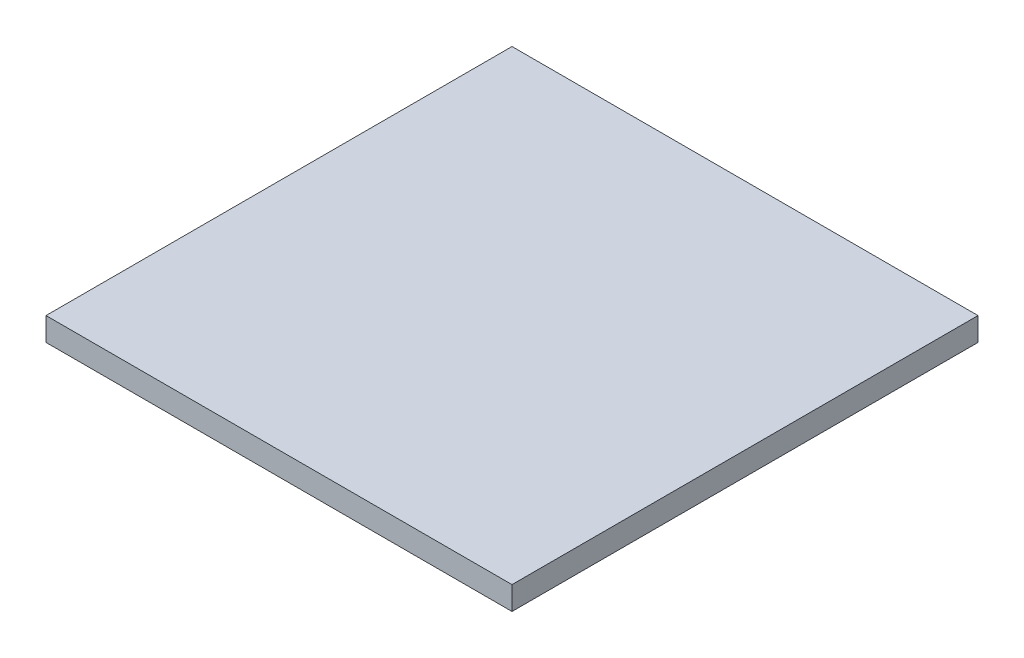
ISO-10303-21;
HEADER;
FILE_DESCRIPTION(('STEP AP214'),'2;1');
FILE_NAME('part.step','',(''),(''),'','','');
FILE_SCHEMA(('AUTOMOTIVE_DESIGN { 1 0 10303 214 1 1 1 1 }'));
ENDSEC;
DATA;
#1=APPLICATION_CONTEXT('core data for automotive mechanical design processes');
#2=APPLICATION_PROTOCOL_DEFINITION('international standard','automotive_design',2000,#1);
#3=PRODUCT_CONTEXT('',#1,'mechanical');
#4=PRODUCT('Part','Part','',(#3));
#5=PRODUCT_RELATED_PRODUCT_CATEGORY('part','',(#4));
#6=PRODUCT_DEFINITION_FORMATION('','',#4);
#7=PRODUCT_DEFINITION_CONTEXT('part definition',#1,'design');
#8=PRODUCT_DEFINITION('design','',#6,#7);
#9=PRODUCT_DEFINITION_SHAPE('','',#8);
#10=(LENGTH_UNIT() NAMED_UNIT(*) SI_UNIT(.MILLI.,.METRE.));
#11=(NAMED_UNIT(*) PLANE_ANGLE_UNIT() SI_UNIT($,.RADIAN.));
#12=(NAMED_UNIT(*) SI_UNIT($,.STERADIAN.) SOLID_ANGLE_UNIT());
#13=UNCERTAINTY_MEASURE_WITH_UNIT(LENGTH_MEASURE(1.E-05),#10,'distance_accuracy_value','');
#14=(GEOMETRIC_REPRESENTATION_CONTEXT(3) GLOBAL_UNCERTAINTY_ASSIGNED_CONTEXT((#13)) GLOBAL_UNIT_ASSIGNED_CONTEXT((#10,
#11,#12)) REPRESENTATION_CONTEXT('',''));
#15=CARTESIAN_POINT('',(0.,0.,0.));
#16=DIRECTION('',(0.,0.,1.));
#17=DIRECTION('',(1.,0.,0.));
#18=AXIS2_PLACEMENT_3D('',#15,#16,#17);
#19=CARTESIAN_POINT('',(-71.219512195122,5.,-36.8292682926829));
#20=DIRECTION('',(1.,0.,0.));
#21=DIRECTION('',(0.,0.,-1.));
#22=AXIS2_PLACEMENT_3D('',#19,#20,#21);
#23=PLANE('',#22);
#24=DIRECTION('',(0.,0.,1.));
#25=VECTOR('',#24,1.);
#26=CARTESIAN_POINT('',(-71.219512195122,0.,-36.8292682926829));
#27=LINE('',#26,#25);
#28=CARTESIAN_POINT('',(-71.219512195122,0.,-36.8292682926829));
#29=VERTEX_POINT('',#28);
#30=CARTESIAN_POINT('',(-71.219512195122,0.,63.1707317073171));
#31=VERTEX_POINT('',#30);
#32=EDGE_CURVE('E113',#29,#31,#27,.T.);
#33=ORIENTED_EDGE('',*,*,#32,.T.);
#34=DIRECTION('',(0.,-1.,0.));
#35=VECTOR('',#34,1.);
#36=CARTESIAN_POINT('',(-71.219512195122,5.,63.1707317073171));
#37=LINE('',#36,#35);
#38=CARTESIAN_POINT('',(-71.219512195122,5.,63.1707317073171));
#39=VERTEX_POINT('',#38);
#40=EDGE_CURVE('E11',#39,#31,#37,.T.);
#41=ORIENTED_EDGE('',*,*,#40,.F.);
#42=DIRECTION('',(0.,0.,1.));
#43=VECTOR('',#42,1.);
#44=CARTESIAN_POINT('',(-71.219512195122,5.,-36.8292682926829));
#45=LINE('',#44,#43);
#46=CARTESIAN_POINT('',(-71.219512195122,5.,-36.8292682926829));
#47=VERTEX_POINT('',#46);
#48=EDGE_CURVE('E97',#47,#39,#45,.T.);
#49=ORIENTED_EDGE('',*,*,#48,.F.);
#50=DIRECTION('',(0.,-1.,0.));
#51=VECTOR('',#50,1.);
#52=CARTESIAN_POINT('',(-71.219512195122,5.,-36.8292682926829));
#53=LINE('',#52,#51);
#54=EDGE_CURVE('E109',#47,#29,#53,.T.);
#55=ORIENTED_EDGE('',*,*,#54,.T.);
#56=EDGE_LOOP('',(#33,#41,#49,#55));
#57=FACE_BOUND('',#56,.T.);
#58=ADVANCED_FACE('F45',(#57),#23,.F.);
#59=CARTESIAN_POINT('',(-71.219512195122,5.,63.1707317073171));
#60=DIRECTION('',(0.,0.,-1.));
#61=DIRECTION('',(-1.,0.,0.));
#62=AXIS2_PLACEMENT_3D('',#59,#60,#61);
#63=PLANE('',#62);
#64=DIRECTION('',(1.,0.,0.));
#65=VECTOR('',#64,1.);
#66=CARTESIAN_POINT('',(-71.219512195122,0.,63.1707317073171));
#67=LINE('',#66,#65);
#68=CARTESIAN_POINT('',(28.7804878048781,0.,63.1707317073171));
#69=VERTEX_POINT('',#68);
#70=EDGE_CURVE('E102',#31,#69,#67,.T.);
#71=ORIENTED_EDGE('',*,*,#70,.T.);
#72=DIRECTION('',(0.,-1.,0.));
#73=VECTOR('',#72,1.);
#74=CARTESIAN_POINT('',(28.7804878048781,5.,63.1707317073171));
#75=LINE('',#74,#73);
#76=CARTESIAN_POINT('',(28.7804878048781,5.,63.1707317073171));
#77=VERTEX_POINT('',#76);
#78=EDGE_CURVE('E54',#77,#69,#75,.T.);
#79=ORIENTED_EDGE('',*,*,#78,.F.);
#80=DIRECTION('',(1.,0.,0.));
#81=VECTOR('',#80,1.);
#82=CARTESIAN_POINT('',(-71.219512195122,5.,63.1707317073171));
#83=LINE('',#82,#81);
#84=EDGE_CURVE('E92',#39,#77,#83,.T.);
#85=ORIENTED_EDGE('',*,*,#84,.F.);
#86=ORIENTED_EDGE('',*,*,#40,.T.);
#87=EDGE_LOOP('',(#71,#79,#85,#86));
#88=FACE_BOUND('',#87,.T.);
#89=ADVANCED_FACE('F101',(#88),#63,.F.);
#90=CARTESIAN_POINT('',(28.7804878048781,5.,-36.8292682926829));
#91=DIRECTION('',(-1.,0.,0.));
#92=DIRECTION('',(0.,0.,1.));
#93=AXIS2_PLACEMENT_3D('',#90,#91,#92);
#94=PLANE('',#93);
#95=DIRECTION('',(0.,0.,-1.));
#96=VECTOR('',#95,1.);
#97=CARTESIAN_POINT('',(28.7804878048781,0.,-36.8292682926829));
#98=LINE('',#97,#96);
#99=CARTESIAN_POINT('',(28.7804878048781,0.,-36.8292682926829));
#100=VERTEX_POINT('',#99);
#101=EDGE_CURVE('E79',#69,#100,#98,.T.);
#102=ORIENTED_EDGE('',*,*,#101,.T.);
#103=DIRECTION('',(0.,-1.,0.));
#104=VECTOR('',#103,1.);
#105=CARTESIAN_POINT('',(28.7804878048781,5.,-36.8292682926829));
#106=LINE('',#105,#104);
#107=CARTESIAN_POINT('',(28.7804878048781,5.,-36.8292682926829));
#108=VERTEX_POINT('',#107);
#109=EDGE_CURVE('E104',#108,#100,#106,.T.);
#110=ORIENTED_EDGE('',*,*,#109,.F.);
#111=DIRECTION('',(0.,0.,-1.));
#112=VECTOR('',#111,1.);
#113=CARTESIAN_POINT('',(28.7804878048781,5.,-36.8292682926829));
#114=LINE('',#113,#112);
#115=EDGE_CURVE('E95',#77,#108,#114,.T.);
#116=ORIENTED_EDGE('',*,*,#115,.F.);
#117=ORIENTED_EDGE('',*,*,#78,.T.);
#118=EDGE_LOOP('',(#102,#110,#116,#117));
#119=FACE_BOUND('',#118,.T.);
#120=ADVANCED_FACE('F105',(#119),#94,.F.);
#121=CARTESIAN_POINT('',(-71.219512195122,5.,-36.8292682926829));
#122=DIRECTION('',(0.,0.,1.));
#123=DIRECTION('',(1.,0.,0.));
#124=AXIS2_PLACEMENT_3D('',#121,#122,#123);
#125=PLANE('',#124);
#126=DIRECTION('',(-1.,0.,0.));
#127=VECTOR('',#126,1.);
#128=CARTESIAN_POINT('',(-71.219512195122,0.,-36.8292682926829));
#129=LINE('',#128,#127);
#130=EDGE_CURVE('E85',#100,#29,#129,.T.);
#131=ORIENTED_EDGE('',*,*,#130,.T.);
#132=ORIENTED_EDGE('',*,*,#54,.F.);
#133=DIRECTION('',(-1.,0.,0.));
#134=VECTOR('',#133,1.);
#135=CARTESIAN_POINT('',(-71.219512195122,5.,-36.8292682926829));
#136=LINE('',#135,#134);
#137=EDGE_CURVE('E62',#108,#47,#136,.T.);
#138=ORIENTED_EDGE('',*,*,#137,.F.);
#139=ORIENTED_EDGE('',*,*,#109,.T.);
#140=EDGE_LOOP('',(#131,#132,#138,#139));
#141=FACE_BOUND('',#140,.T.);
#142=ADVANCED_FACE('F126',(#141),#125,.F.);
#143=CARTESIAN_POINT('',(0.,5.,0.));
#144=DIRECTION('',(0.,1.,0.));
#145=DIRECTION('',(0.,0.,1.));
#146=AXIS2_PLACEMENT_3D('',#143,#144,#145);
#147=PLANE('',#146);
#148=ORIENTED_EDGE('',*,*,#48,.T.);
#149=ORIENTED_EDGE('',*,*,#84,.T.);
#150=ORIENTED_EDGE('',*,*,#115,.T.);
#151=ORIENTED_EDGE('',*,*,#137,.T.);
#152=EDGE_LOOP('',(#148,#149,#150,#151));
#153=FACE_BOUND('',#152,.T.);
#154=ADVANCED_FACE('F93',(#153),#147,.T.);
#155=CARTESIAN_POINT('',(0.,0.,0.));
#156=DIRECTION('',(0.,1.,0.));
#157=DIRECTION('',(0.,0.,1.));
#158=AXIS2_PLACEMENT_3D('',#155,#156,#157);
#159=PLANE('',#158);
#160=ORIENTED_EDGE('',*,*,#32,.F.);
#161=ORIENTED_EDGE('',*,*,#130,.F.);
#162=ORIENTED_EDGE('',*,*,#101,.F.);
#163=ORIENTED_EDGE('',*,*,#70,.F.);
#164=EDGE_LOOP('',(#160,#161,#162,#163));
#165=FACE_BOUND('',#164,.T.);
#166=ADVANCED_FACE('F129',(#165),#159,.F.);
#167=CLOSED_SHELL('',(#58,#89,#120,#142,#154,#166));
#168=MANIFOLD_SOLID_BREP('B2',#167);
#169=ADVANCED_BREP_SHAPE_REPRESENTATION('',(#18,#168),#14);
#170=SHAPE_DEFINITION_REPRESENTATION(#9,#169);
ENDSEC;
END-ISO-10303-21;
